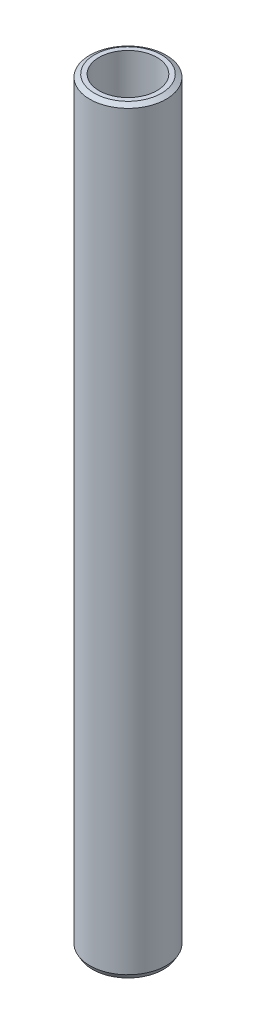
ISO-10303-21;
HEADER;
FILE_DESCRIPTION(('STEP AP214'),'2;1');
FILE_NAME('part.step','',(''),(''),'','','');
FILE_SCHEMA(('AUTOMOTIVE_DESIGN { 1 0 10303 214 1 1 1 1 }'));
ENDSEC;
DATA;
#1=APPLICATION_CONTEXT('core data for automotive mechanical design processes');
#2=APPLICATION_PROTOCOL_DEFINITION('international standard','automotive_design',2000,#1);
#3=PRODUCT_CONTEXT('',#1,'mechanical');
#4=PRODUCT('Part','Part','',(#3));
#5=PRODUCT_RELATED_PRODUCT_CATEGORY('part','',(#4));
#6=PRODUCT_DEFINITION_FORMATION('','',#4);
#7=PRODUCT_DEFINITION_CONTEXT('part definition',#1,'design');
#8=PRODUCT_DEFINITION('design','',#6,#7);
#9=PRODUCT_DEFINITION_SHAPE('','',#8);
#10=(LENGTH_UNIT() NAMED_UNIT(*) SI_UNIT(.MILLI.,.METRE.));
#11=(NAMED_UNIT(*) PLANE_ANGLE_UNIT() SI_UNIT($,.RADIAN.));
#12=(NAMED_UNIT(*) SI_UNIT($,.STERADIAN.) SOLID_ANGLE_UNIT());
#13=UNCERTAINTY_MEASURE_WITH_UNIT(LENGTH_MEASURE(1.E-05),#10,'distance_accuracy_value','');
#14=(GEOMETRIC_REPRESENTATION_CONTEXT(3) GLOBAL_UNCERTAINTY_ASSIGNED_CONTEXT((#13)) GLOBAL_UNIT_ASSIGNED_CONTEXT((#10,
#11,#12)) REPRESENTATION_CONTEXT('',''));
#15=CARTESIAN_POINT('',(0.,0.,0.));
#16=DIRECTION('',(0.,0.,1.));
#17=DIRECTION('',(1.,0.,0.));
#18=AXIS2_PLACEMENT_3D('',#15,#16,#17);
#19=CARTESIAN_POINT('',(0.,545.613754605391,0.));
#20=DIRECTION('',(0.,-1.,0.));
#21=DIRECTION('',(0.,0.,-1.));
#22=AXIS2_PLACEMENT_3D('',#19,#20,#21);
#23=CYLINDRICAL_SURFACE('',#22,27.5);
#24=CARTESIAN_POINT('',(0.,543.642549188339,0.));
#25=DIRECTION('',(0.,1.,0.));
#26=DIRECTION('',(0.,0.,1.));
#27=AXIS2_PLACEMENT_3D('',#24,#25,#26);
#28=CIRCLE('',#27,27.5);
#29=CARTESIAN_POINT('',(0.,543.642549188339,27.5));
#30=VERTEX_POINT('',#29);
#31=EDGE_CURVE('E50',#30,#30,#28,.F.);
#32=ORIENTED_EDGE('',*,*,#31,.T.);
#33=EDGE_LOOP('',(#32));
#34=FACE_BOUND('',#33,.T.);
#35=CARTESIAN_POINT('',(0.,3.4142279344892,0.));
#36=DIRECTION('',(0.,1.,0.));
#37=DIRECTION('',(0.,0.,1.));
#38=AXIS2_PLACEMENT_3D('',#35,#36,#37);
#39=CIRCLE('',#38,27.5);
#40=CARTESIAN_POINT('',(0.,3.4142279344892,27.5));
#41=VERTEX_POINT('',#40);
#42=EDGE_CURVE('E51',#41,#41,#39,.T.);
#43=ORIENTED_EDGE('',*,*,#42,.T.);
#44=EDGE_LOOP('',(#43));
#45=FACE_BOUND('',#44,.T.);
#46=ADVANCED_FACE('F39',(#34,#45),#23,.T.);
#47=CARTESIAN_POINT('',(0.,545.613754605391,0.));
#48=DIRECTION('',(0.,1.,0.));
#49=DIRECTION('',(0.,0.,1.));
#50=AXIS2_PLACEMENT_3D('',#47,#48,#49);
#51=PLANE('',#50);
#52=CARTESIAN_POINT('',(0.,545.613754605391,0.));
#53=DIRECTION('',(0.,1.,0.));
#54=DIRECTION('',(0.,0.,1.));
#55=AXIS2_PLACEMENT_3D('',#52,#53,#54);
#56=CIRCLE('',#55,24.0857720655104);
#57=CARTESIAN_POINT('',(0.,545.613754605391,24.0857720655104));
#58=VERTEX_POINT('',#57);
#59=EDGE_CURVE('E54',#58,#58,#56,.T.);
#60=ORIENTED_EDGE('',*,*,#59,.T.);
#61=EDGE_LOOP('',(#60));
#62=FACE_BOUND('',#61,.T.);
#63=CARTESIAN_POINT('',(0.,545.613754605391,0.));
#64=DIRECTION('',(0.,1.,0.));
#65=DIRECTION('',(0.,0.,1.));
#66=AXIS2_PLACEMENT_3D('',#63,#64,#65);
#67=CIRCLE('',#66,20.8105499871406);
#68=CARTESIAN_POINT('',(0.,545.613754605391,20.8105499871406));
#69=VERTEX_POINT('',#68);
#70=EDGE_CURVE('E58',#69,#69,#67,.T.);
#71=ORIENTED_EDGE('',*,*,#70,.F.);
#72=EDGE_LOOP('',(#71));
#73=FACE_BOUND('',#72,.T.);
#74=ADVANCED_FACE('F69',(#62,#73),#51,.T.);
#75=CARTESIAN_POINT('',(0.,0.,0.));
#76=DIRECTION('',(0.,1.,0.));
#77=DIRECTION('',(0.,0.,1.));
#78=AXIS2_PLACEMENT_3D('',#75,#76,#77);
#79=PLANE('',#78);
#80=CARTESIAN_POINT('',(0.,0.,0.));
#81=DIRECTION('',(0.,1.,0.));
#82=DIRECTION('',(0.,0.,1.));
#83=AXIS2_PLACEMENT_3D('',#80,#81,#82);
#84=CIRCLE('',#83,25.5287945829479);
#85=CARTESIAN_POINT('',(0.,0.,25.5287945829479));
#86=VERTEX_POINT('',#85);
#87=EDGE_CURVE('E10',#86,#86,#84,.F.);
#88=ORIENTED_EDGE('',*,*,#87,.T.);
#89=EDGE_LOOP('',(#88));
#90=FACE_BOUND('',#89,.T.);
#91=CARTESIAN_POINT('',(0.,0.,0.));
#92=DIRECTION('',(0.,1.,0.));
#93=DIRECTION('',(0.,0.,1.));
#94=AXIS2_PLACEMENT_3D('',#91,#92,#93);
#95=CIRCLE('',#94,20.8105499871406);
#96=CARTESIAN_POINT('',(0.,0.,20.8105499871406));
#97=VERTEX_POINT('',#96);
#98=EDGE_CURVE('E63',#97,#97,#95,.T.);
#99=ORIENTED_EDGE('',*,*,#98,.T.);
#100=EDGE_LOOP('',(#99));
#101=FACE_BOUND('',#100,.T.);
#102=ADVANCED_FACE('F75',(#90,#101),#79,.F.);
#103=CARTESIAN_POINT('',(0.,545.613754605391,0.));
#104=DIRECTION('',(0.,-1.,0.));
#105=DIRECTION('',(0.,0.,-1.));
#106=AXIS2_PLACEMENT_3D('',#103,#104,#105);
#107=CYLINDRICAL_SURFACE('',#106,20.8105499871406);
#108=ORIENTED_EDGE('',*,*,#70,.T.);
#109=EDGE_LOOP('',(#108));
#110=FACE_BOUND('',#109,.T.);
#111=ORIENTED_EDGE('',*,*,#98,.F.);
#112=EDGE_LOOP('',(#111));
#113=FACE_BOUND('',#112,.T.);
#114=ADVANCED_FACE('F70',(#110,#113),#107,.F.);
#115=CARTESIAN_POINT('',(0.,545.613754605391,0.));
#116=DIRECTION('',(0.,-1.,0.));
#117=DIRECTION('',(0.,0.,-1.));
#118=AXIS2_PLACEMENT_3D('',#115,#116,#117);
#119=CONICAL_SURFACE('',#118,24.0857720655104,1.04719755119662);
#120=ORIENTED_EDGE('',*,*,#31,.F.);
#121=EDGE_LOOP('',(#120));
#122=FACE_BOUND('',#121,.T.);
#123=ORIENTED_EDGE('',*,*,#59,.F.);
#124=EDGE_LOOP('',(#123));
#125=FACE_BOUND('',#124,.T.);
#126=ADVANCED_FACE('F81',(#122,#125),#119,.T.);
#127=CARTESIAN_POINT('',(0.,3.4142279344892,0.));
#128=DIRECTION('',(0.,1.,0.));
#129=DIRECTION('',(0.,0.,1.));
#130=AXIS2_PLACEMENT_3D('',#127,#128,#129);
#131=CONICAL_SURFACE('',#130,27.5,0.523598775598309);
#132=ORIENTED_EDGE('',*,*,#87,.F.);
#133=EDGE_LOOP('',(#132));
#134=FACE_BOUND('',#133,.T.);
#135=ORIENTED_EDGE('',*,*,#42,.F.);
#136=EDGE_LOOP('',(#135));
#137=FACE_BOUND('',#136,.T.);
#138=ADVANCED_FACE('F45',(#134,#137),#131,.T.);
#139=CLOSED_SHELL('',(#46,#74,#102,#114,#126,#138));
#140=MANIFOLD_SOLID_BREP('B2',#139);
#141=ADVANCED_BREP_SHAPE_REPRESENTATION('',(#18,#140),#14);
#142=SHAPE_DEFINITION_REPRESENTATION(#9,#141);
ENDSEC;
END-ISO-10303-21;
